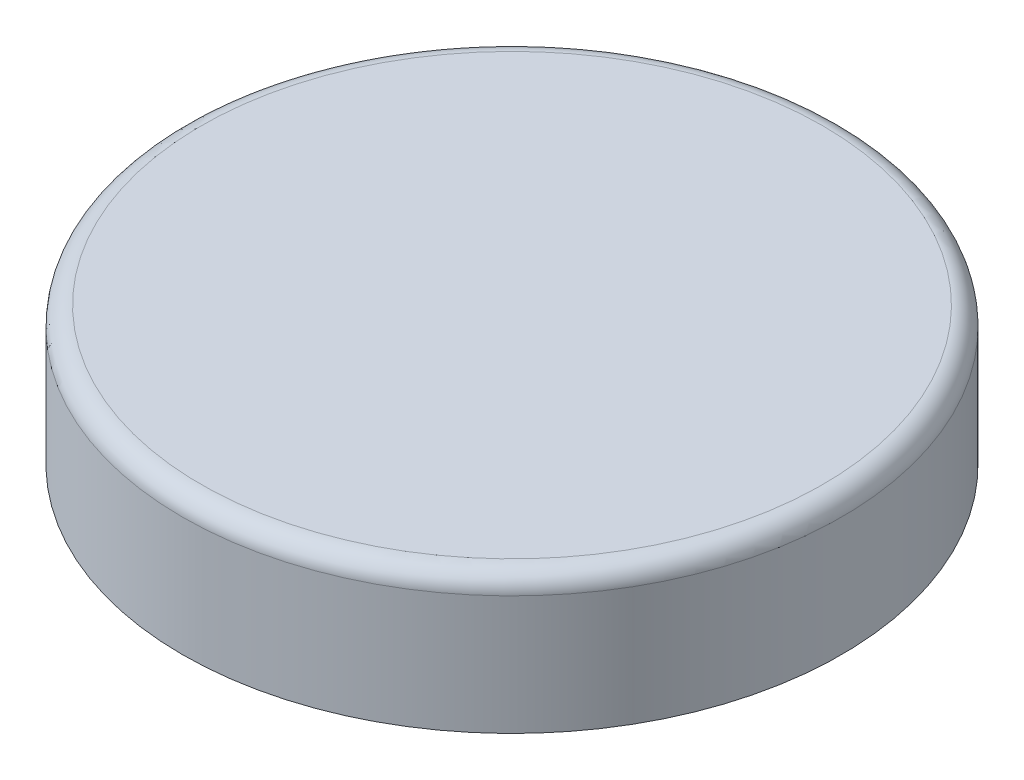
ISO-10303-21;
HEADER;
FILE_DESCRIPTION(('STEP AP214'),'2;1');
FILE_NAME('part.step','',(''),(''),'','','');
FILE_SCHEMA(('AUTOMOTIVE_DESIGN { 1 0 10303 214 1 1 1 1 }'));
ENDSEC;
DATA;
#1=APPLICATION_CONTEXT('core data for automotive mechanical design processes');
#2=APPLICATION_PROTOCOL_DEFINITION('international standard','automotive_design',2000,#1);
#3=PRODUCT_CONTEXT('',#1,'mechanical');
#4=PRODUCT('Part','Part','',(#3));
#5=PRODUCT_RELATED_PRODUCT_CATEGORY('part','',(#4));
#6=PRODUCT_DEFINITION_FORMATION('','',#4);
#7=PRODUCT_DEFINITION_CONTEXT('part definition',#1,'design');
#8=PRODUCT_DEFINITION('design','',#6,#7);
#9=PRODUCT_DEFINITION_SHAPE('','',#8);
#10=(LENGTH_UNIT() NAMED_UNIT(*) SI_UNIT(.MILLI.,.METRE.));
#11=(NAMED_UNIT(*) PLANE_ANGLE_UNIT() SI_UNIT($,.RADIAN.));
#12=(NAMED_UNIT(*) SI_UNIT($,.STERADIAN.) SOLID_ANGLE_UNIT());
#13=UNCERTAINTY_MEASURE_WITH_UNIT(LENGTH_MEASURE(1.E-05),#10,'distance_accuracy_value','');
#14=(GEOMETRIC_REPRESENTATION_CONTEXT(3) GLOBAL_UNCERTAINTY_ASSIGNED_CONTEXT((#13)) GLOBAL_UNIT_ASSIGNED_CONTEXT((#10,
#11,#12)) REPRESENTATION_CONTEXT('',''));
#15=CARTESIAN_POINT('',(0.,0.,0.));
#16=DIRECTION('',(0.,0.,1.));
#17=DIRECTION('',(1.,0.,0.));
#18=AXIS2_PLACEMENT_3D('',#15,#16,#17);
#19=CARTESIAN_POINT('',(0.,0.,0.));
#20=DIRECTION('',(0.,1.,0.));
#21=DIRECTION('',(0.,0.,1.));
#22=AXIS2_PLACEMENT_3D('',#19,#20,#21);
#23=PLANE('',#22);
#24=CARTESIAN_POINT('',(0.,0.,0.));
#25=DIRECTION('',(0.,-1.,0.));
#26=DIRECTION('',(0.,0.,-1.));
#27=AXIS2_PLACEMENT_3D('',#24,#25,#26);
#28=CIRCLE('',#27,166.8859375);
#29=CARTESIAN_POINT('',(0.,0.,-166.8859375));
#30=VERTEX_POINT('',#29);
#31=EDGE_CURVE('E44',#30,#30,#28,.T.);
#32=ORIENTED_EDGE('',*,*,#31,.T.);
#33=EDGE_LOOP('',(#32));
#34=FACE_BOUND('',#33,.T.);
#35=CARTESIAN_POINT('',(0.,0.,0.));
#36=DIRECTION('',(0.,1.,0.));
#37=DIRECTION('',(0.,0.,1.));
#38=AXIS2_PLACEMENT_3D('',#35,#36,#37);
#39=CIRCLE('',#38,162.1234375);
#40=CARTESIAN_POINT('',(0.,0.,162.1234375));
#41=VERTEX_POINT('',#40);
#42=EDGE_CURVE('E51',#41,#41,#39,.F.);
#43=ORIENTED_EDGE('',*,*,#42,.F.);
#44=EDGE_LOOP('',(#43));
#45=FACE_BOUND('',#44,.T.);
#46=ADVANCED_FACE('F33',(#34,#45),#23,.F.);
#47=CARTESIAN_POINT('',(0.,0.,0.));
#48=DIRECTION('',(0.,-1.,0.));
#49=DIRECTION('',(0.,0.,-1.));
#50=AXIS2_PLACEMENT_3D('',#47,#48,#49);
#51=CYLINDRICAL_SURFACE('',#50,166.8859375);
#52=CARTESIAN_POINT('',(0.,60.325,0.));
#53=DIRECTION('',(0.,-1.,0.));
#54=DIRECTION('',(0.,0.,-1.));
#55=AXIS2_PLACEMENT_3D('',#52,#53,#54);
#56=CIRCLE('',#55,166.8859375);
#57=CARTESIAN_POINT('',(0.,60.325,-166.8859375));
#58=VERTEX_POINT('',#57);
#59=EDGE_CURVE('E40',#58,#58,#56,.T.);
#60=ORIENTED_EDGE('',*,*,#59,.T.);
#61=EDGE_LOOP('',(#60));
#62=FACE_BOUND('',#61,.T.);
#63=ORIENTED_EDGE('',*,*,#31,.F.);
#64=EDGE_LOOP('',(#63));
#65=FACE_BOUND('',#64,.T.);
#66=ADVANCED_FACE('F70',(#62,#65),#51,.T.);
#67=CARTESIAN_POINT('',(0.,69.85,166.8859375));
#68=DIRECTION('',(0.,-1.,0.));
#69=DIRECTION('',(0.,0.,-1.));
#70=AXIS2_PLACEMENT_3D('',#67,#68,#69);
#71=PLANE('',#70);
#72=CARTESIAN_POINT('',(0.,69.85,0.));
#73=DIRECTION('',(0.,-1.,0.));
#74=DIRECTION('',(0.,0.,-1.));
#75=AXIS2_PLACEMENT_3D('',#72,#73,#74);
#76=CIRCLE('',#75,157.3609375);
#77=CARTESIAN_POINT('',(0.,69.85,-157.3609375));
#78=VERTEX_POINT('',#77);
#79=EDGE_CURVE('E10',#78,#78,#76,.F.);
#80=ORIENTED_EDGE('',*,*,#79,.T.);
#81=EDGE_LOOP('',(#80));
#82=FACE_BOUND('',#81,.T.);
#83=ADVANCED_FACE('F75',(#82),#71,.F.);
#84=CARTESIAN_POINT('',(0.,60.325,0.));
#85=DIRECTION('',(0.,-1.,0.));
#86=DIRECTION('',(0.,0.,-1.));
#87=AXIS2_PLACEMENT_3D('',#84,#85,#86);
#88=TOROIDAL_SURFACE('',#87,157.3609375,9.525);
#89=ORIENTED_EDGE('',*,*,#79,.F.);
#90=EDGE_LOOP('',(#89));
#91=FACE_BOUND('',#90,.T.);
#92=ORIENTED_EDGE('',*,*,#59,.F.);
#93=EDGE_LOOP('',(#92));
#94=FACE_BOUND('',#93,.T.);
#95=ADVANCED_FACE('F35',(#91,#94),#88,.T.);
#96=CARTESIAN_POINT('',(0.,0.,0.));
#97=DIRECTION('',(0.,-1.,0.));
#98=DIRECTION('',(0.,0.,-1.));
#99=AXIS2_PLACEMENT_3D('',#96,#97,#98);
#100=CYLINDRICAL_SURFACE('',#99,162.1234375);
#101=CARTESIAN_POINT('',(0.,60.325,0.));
#102=DIRECTION('',(0.,-1.,0.));
#103=DIRECTION('',(0.,0.,-1.));
#104=AXIS2_PLACEMENT_3D('',#101,#102,#103);
#105=CIRCLE('',#104,162.1234375);
#106=CARTESIAN_POINT('',(0.,60.325,-162.1234375));
#107=VERTEX_POINT('',#106);
#108=EDGE_CURVE('E54',#107,#107,#105,.T.);
#109=ORIENTED_EDGE('',*,*,#108,.F.);
#110=EDGE_LOOP('',(#109));
#111=FACE_BOUND('',#110,.T.);
#112=ORIENTED_EDGE('',*,*,#42,.T.);
#113=EDGE_LOOP('',(#112));
#114=FACE_BOUND('',#113,.T.);
#115=ADVANCED_FACE('F62',(#111,#114),#100,.F.);
#116=CARTESIAN_POINT('',(0.,65.0875,166.8859375));
#117=DIRECTION('',(0.,-1.,0.));
#118=DIRECTION('',(0.,0.,-1.));
#119=AXIS2_PLACEMENT_3D('',#116,#117,#118);
#120=PLANE('',#119);
#121=CARTESIAN_POINT('',(0.,65.0875,0.));
#122=DIRECTION('',(0.,-1.,0.));
#123=DIRECTION('',(0.,0.,-1.));
#124=AXIS2_PLACEMENT_3D('',#121,#122,#123);
#125=CIRCLE('',#124,157.3609375);
#126=CARTESIAN_POINT('',(0.,65.0875,-157.3609375));
#127=VERTEX_POINT('',#126);
#128=EDGE_CURVE('E48',#127,#127,#125,.F.);
#129=ORIENTED_EDGE('',*,*,#128,.F.);
#130=EDGE_LOOP('',(#129));
#131=FACE_BOUND('',#130,.T.);
#132=ADVANCED_FACE('F65',(#131),#120,.T.);
#133=CARTESIAN_POINT('',(0.,60.325,0.));
#134=DIRECTION('',(0.,-1.,0.));
#135=DIRECTION('',(0.,0.,-1.));
#136=AXIS2_PLACEMENT_3D('',#133,#134,#135);
#137=TOROIDAL_SURFACE('',#136,157.3609375,4.7625);
#138=ORIENTED_EDGE('',*,*,#128,.T.);
#139=EDGE_LOOP('',(#138));
#140=FACE_BOUND('',#139,.T.);
#141=ORIENTED_EDGE('',*,*,#108,.T.);
#142=EDGE_LOOP('',(#141));
#143=FACE_BOUND('',#142,.T.);
#144=ADVANCED_FACE('F60',(#140,#143),#137,.F.);
#145=CLOSED_SHELL('',(#46,#66,#83,#95,#115,#132,#144));
#146=MANIFOLD_SOLID_BREP('B2',#145);
#147=ADVANCED_BREP_SHAPE_REPRESENTATION('',(#18,#146),#14);
#148=SHAPE_DEFINITION_REPRESENTATION(#9,#147);
ENDSEC;
END-ISO-10303-21;
